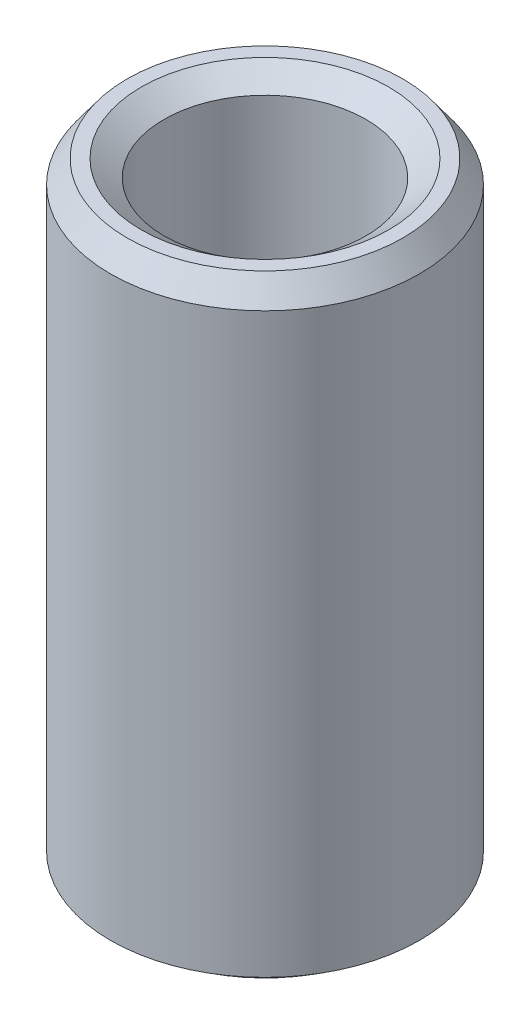
ISO-10303-21;
HEADER;
FILE_DESCRIPTION(('STEP AP214'),'2;1');
FILE_NAME('part.step','',(''),(''),'','','');
FILE_SCHEMA(('AUTOMOTIVE_DESIGN { 1 0 10303 214 1 1 1 1 }'));
ENDSEC;
DATA;
#1=APPLICATION_CONTEXT('core data for automotive mechanical design processes');
#2=APPLICATION_PROTOCOL_DEFINITION('international standard','automotive_design',2000,#1);
#3=PRODUCT_CONTEXT('',#1,'mechanical');
#4=PRODUCT('Part','Part','',(#3));
#5=PRODUCT_RELATED_PRODUCT_CATEGORY('part','',(#4));
#6=PRODUCT_DEFINITION_FORMATION('','',#4);
#7=PRODUCT_DEFINITION_CONTEXT('part definition',#1,'design');
#8=PRODUCT_DEFINITION('design','',#6,#7);
#9=PRODUCT_DEFINITION_SHAPE('','',#8);
#10=(LENGTH_UNIT() NAMED_UNIT(*) SI_UNIT(.MILLI.,.METRE.));
#11=(NAMED_UNIT(*) PLANE_ANGLE_UNIT() SI_UNIT($,.RADIAN.));
#12=(NAMED_UNIT(*) SI_UNIT($,.STERADIAN.) SOLID_ANGLE_UNIT());
#13=UNCERTAINTY_MEASURE_WITH_UNIT(LENGTH_MEASURE(1.E-05),#10,'distance_accuracy_value','');
#14=(GEOMETRIC_REPRESENTATION_CONTEXT(3) GLOBAL_UNCERTAINTY_ASSIGNED_CONTEXT((#13)) GLOBAL_UNIT_ASSIGNED_CONTEXT((#10,
#11,#12)) REPRESENTATION_CONTEXT('',''));
#15=CARTESIAN_POINT('',(0.,0.,0.));
#16=DIRECTION('',(0.,0.,1.));
#17=DIRECTION('',(1.,0.,0.));
#18=AXIS2_PLACEMENT_3D('',#15,#16,#17);
#19=CARTESIAN_POINT('',(0.,29.938073754065,0.));
#20=DIRECTION('',(0.,-1.,0.));
#21=DIRECTION('',(0.,0.,-1.));
#22=AXIS2_PLACEMENT_3D('',#19,#20,#21);
#23=CYLINDRICAL_SURFACE('',#22,7.5);
#24=CARTESIAN_POINT('',(0.,0.808139164973461,0.));
#25=DIRECTION('',(0.,1.,0.));
#26=DIRECTION('',(0.,0.,1.));
#27=AXIS2_PLACEMENT_3D('',#24,#25,#26);
#28=CIRCLE('',#27,7.5);
#29=CARTESIAN_POINT('',(0.,0.808139164973461,7.5));
#30=VERTEX_POINT('',#29);
#31=EDGE_CURVE('E10',#30,#30,#28,.T.);
#32=ORIENTED_EDGE('',*,*,#31,.T.);
#33=EDGE_LOOP('',(#32));
#34=FACE_BOUND('',#33,.T.);
#35=CARTESIAN_POINT('',(0.,28.8325355370839,0.));
#36=DIRECTION('',(0.,1.,0.));
#37=DIRECTION('',(0.,0.,1.));
#38=AXIS2_PLACEMENT_3D('',#35,#36,#37);
#39=CIRCLE('',#38,7.5);
#40=CARTESIAN_POINT('',(0.,28.8325355370839,7.5));
#41=VERTEX_POINT('',#40);
#42=EDGE_CURVE('E50',#41,#41,#39,.F.);
#43=ORIENTED_EDGE('',*,*,#42,.T.);
#44=EDGE_LOOP('',(#43));
#45=FACE_BOUND('',#44,.T.);
#46=ADVANCED_FACE('F39',(#34,#45),#23,.T.);
#47=CARTESIAN_POINT('',(0.,29.938073754065,0.));
#48=DIRECTION('',(0.,1.,0.));
#49=DIRECTION('',(0.,0.,1.));
#50=AXIS2_PLACEMENT_3D('',#47,#48,#49);
#51=PLANE('',#50);
#52=CARTESIAN_POINT('',(0.,29.938073754065,0.));
#53=DIRECTION('',(0.,1.,0.));
#54=DIRECTION('',(0.,0.,1.));
#55=AXIS2_PLACEMENT_3D('',#52,#53,#54);
#56=CIRCLE('',#55,6.00777478920314);
#57=CARTESIAN_POINT('',(0.,29.938073754065,6.00777478920314));
#58=VERTEX_POINT('',#57);
#59=EDGE_CURVE('E58',#58,#58,#56,.F.);
#60=ORIENTED_EDGE('',*,*,#59,.T.);
#61=EDGE_LOOP('',(#60));
#62=FACE_BOUND('',#61,.T.);
#63=CARTESIAN_POINT('',(0.,29.938073754065,0.));
#64=DIRECTION('',(0.,1.,0.));
#65=DIRECTION('',(0.,0.,1.));
#66=AXIS2_PLACEMENT_3D('',#63,#64,#65);
#67=CIRCLE('',#66,6.69186083502653);
#68=CARTESIAN_POINT('',(0.,29.938073754065,6.69186083502653));
#69=VERTEX_POINT('',#68);
#70=EDGE_CURVE('E61',#69,#69,#67,.T.);
#71=ORIENTED_EDGE('',*,*,#70,.T.);
#72=EDGE_LOOP('',(#71));
#73=FACE_BOUND('',#72,.T.);
#74=ADVANCED_FACE('F88',(#62,#73),#51,.T.);
#75=CARTESIAN_POINT('',(0.,0.,0.));
#76=DIRECTION('',(0.,1.,0.));
#77=DIRECTION('',(0.,0.,1.));
#78=AXIS2_PLACEMENT_3D('',#75,#76,#77);
#79=PLANE('',#78);
#80=CARTESIAN_POINT('',(0.,0.,0.));
#81=DIRECTION('',(0.,1.,0.));
#82=DIRECTION('',(0.,0.,1.));
#83=AXIS2_PLACEMENT_3D('',#80,#81,#82);
#84=CIRCLE('',#83,5.7103757371955);
#85=CARTESIAN_POINT('',(0.,0.,5.7103757371955));
#86=VERTEX_POINT('',#85);
#87=EDGE_CURVE('E51',#86,#86,#84,.T.);
#88=ORIENTED_EDGE('',*,*,#87,.T.);
#89=EDGE_LOOP('',(#88));
#90=FACE_BOUND('',#89,.T.);
#91=CARTESIAN_POINT('',(0.,0.,0.));
#92=DIRECTION('',(0.,1.,0.));
#93=DIRECTION('',(0.,0.,1.));
#94=AXIS2_PLACEMENT_3D('',#91,#92,#93);
#95=CIRCLE('',#94,6.39446178301889);
#96=CARTESIAN_POINT('',(0.,0.,6.39446178301889));
#97=VERTEX_POINT('',#96);
#98=EDGE_CURVE('E54',#97,#97,#95,.F.);
#99=ORIENTED_EDGE('',*,*,#98,.T.);
#100=EDGE_LOOP('',(#99));
#101=FACE_BOUND('',#100,.T.);
#102=ADVANCED_FACE('F83',(#90,#101),#79,.F.);
#103=CARTESIAN_POINT('',(0.,29.938073754065,0.));
#104=DIRECTION('',(0.,-1.,0.));
#105=DIRECTION('',(0.,0.,-1.));
#106=AXIS2_PLACEMENT_3D('',#103,#104,#105);
#107=CYLINDRICAL_SURFACE('',#106,4.90223657222204);
#108=CARTESIAN_POINT('',(0.,29.1299345890916,0.));
#109=DIRECTION('',(0.,1.,0.));
#110=DIRECTION('',(0.,0.,1.));
#111=AXIS2_PLACEMENT_3D('',#108,#109,#110);
#112=CIRCLE('',#111,4.90223657222204);
#113=CARTESIAN_POINT('',(0.,29.1299345890916,4.90223657222204));
#114=VERTEX_POINT('',#113);
#115=EDGE_CURVE('E67',#114,#114,#112,.T.);
#116=ORIENTED_EDGE('',*,*,#115,.T.);
#117=EDGE_LOOP('',(#116));
#118=FACE_BOUND('',#117,.T.);
#119=CARTESIAN_POINT('',(0.,1.10553821698111,0.));
#120=DIRECTION('',(0.,1.,0.));
#121=DIRECTION('',(0.,0.,1.));
#122=AXIS2_PLACEMENT_3D('',#119,#120,#121);
#123=CIRCLE('',#122,4.90223657222204);
#124=CARTESIAN_POINT('',(0.,1.10553821698111,4.90223657222204));
#125=VERTEX_POINT('',#124);
#126=EDGE_CURVE('E69',#125,#125,#123,.F.);
#127=ORIENTED_EDGE('',*,*,#126,.T.);
#128=EDGE_LOOP('',(#127));
#129=FACE_BOUND('',#128,.T.);
#130=ADVANCED_FACE('F71',(#118,#129),#107,.F.);
#131=CARTESIAN_POINT('',(0.,29.1299345890916,0.));
#132=DIRECTION('',(0.,1.,0.));
#133=DIRECTION('',(0.,0.,1.));
#134=AXIS2_PLACEMENT_3D('',#131,#132,#133);
#135=CONICAL_SURFACE('',#134,4.90223657222204,0.939571987757114);
#136=CARTESIAN_POINT('',(0.,29.938073754065,6.00777478920314));
#137=CARTESIAN_POINT('',(0.,29.9296556377632,5.99625876610959));
#138=CARTESIAN_POINT('',(0.,29.9212375214614,5.98474274301604));
#139=CARTESIAN_POINT('',(0.,29.9044012888578,5.96171069682893));
#140=CARTESIAN_POINT('',(0.,29.895983172556,5.95019467373538));
#141=CARTESIAN_POINT('',(0.,29.8791469399524,5.92716262754827));
#142=CARTESIAN_POINT('',(0.,29.8707288236506,5.91564660445472));
#143=CARTESIAN_POINT('',(0.,29.853892591047,5.89261455826761));
#144=CARTESIAN_POINT('',(0.,29.8454744747452,5.88109853517406));
#145=CARTESIAN_POINT('',(0.,29.8286382421415,5.85806648898695));
#146=CARTESIAN_POINT('',(0.,29.8202201258397,5.8465504658934));
#147=CARTESIAN_POINT('',(0.,29.8033838932361,5.82351841970629));
#148=CARTESIAN_POINT('',(0.,29.7949657769343,5.81200239661274));
#149=CARTESIAN_POINT('',(0.,29.7781295443307,5.78897035042563));
#150=CARTESIAN_POINT('',(0.,29.7697114280289,5.77745432733208));
#151=CARTESIAN_POINT('',(0.,29.7528751954253,5.75442228114497));
#152=CARTESIAN_POINT('',(0.,29.7444570791235,5.74290625805142));
#153=CARTESIAN_POINT('',(0.,29.7276208465199,5.71987421186431));
#154=CARTESIAN_POINT('',(0.,29.7192027302181,5.70835818877076));
#155=CARTESIAN_POINT('',(0.,29.7023664976144,5.68532614258365));
#156=CARTESIAN_POINT('',(0.,29.6939483813126,5.6738101194901));
#157=CARTESIAN_POINT('',(0.,29.677112148709,5.65077807330299));
#158=CARTESIAN_POINT('',(0.,29.6686940324072,5.63926205020944));
#159=CARTESIAN_POINT('',(0.,29.6518577998036,5.61623000402234));
#160=CARTESIAN_POINT('',(0.,29.6434396835018,5.60471398092878));
#161=CARTESIAN_POINT('',(0.,29.6266034508982,5.58168193474167));
#162=CARTESIAN_POINT('',(0.,29.6181853345964,5.57016591164812));
#163=CARTESIAN_POINT('',(0.,29.6013491019928,5.54713386546102));
#164=CARTESIAN_POINT('',(0.,29.5929309856909,5.53561784236746));
#165=CARTESIAN_POINT('',(0.,29.5760947530873,5.51258579618036));
#166=CARTESIAN_POINT('',(0.,29.5676766367855,5.5010697730868));
#167=CARTESIAN_POINT('',(0.,29.5508404041819,5.4780377268997));
#168=CARTESIAN_POINT('',(0.,29.5424222878801,5.46652170380614));
#169=CARTESIAN_POINT('',(0.,29.5255860552765,5.44348965761904));
#170=CARTESIAN_POINT('',(0.,29.5171679389747,5.43197363452548));
#171=CARTESIAN_POINT('',(0.,29.5003317063711,5.40894158833838));
#172=CARTESIAN_POINT('',(0.,29.4919135900693,5.39742556524483));
#173=CARTESIAN_POINT('',(0.,29.4750773574657,5.37439351905772));
#174=CARTESIAN_POINT('',(0.,29.4666592411638,5.36287749596416));
#175=CARTESIAN_POINT('',(0.,29.4498230085602,5.33984544977706));
#176=CARTESIAN_POINT('',(0.,29.4414048922584,5.32832942668351));
#177=CARTESIAN_POINT('',(0.,29.4245686596548,5.3052973804964));
#178=CARTESIAN_POINT('',(0.,29.416150543353,5.29378135740285));
#179=CARTESIAN_POINT('',(0.,29.3993143107494,5.27074931121574));
#180=CARTESIAN_POINT('',(0.,29.3908961944476,5.25923328812219));
#181=CARTESIAN_POINT('',(0.,29.374059961844,5.23620124193508));
#182=CARTESIAN_POINT('',(0.,29.3656418455422,5.22468521884153));
#183=CARTESIAN_POINT('',(0.,29.3488056129385,5.20165317265442));
#184=CARTESIAN_POINT('',(0.,29.3403874966367,5.19013714956087));
#185=CARTESIAN_POINT('',(0.,29.3235512640331,5.16710510337376));
#186=CARTESIAN_POINT('',(0.,29.3151331477313,5.15558908028021));
#187=CARTESIAN_POINT('',(0.,29.2982969151277,5.1325570340931));
#188=CARTESIAN_POINT('',(0.,29.2898787988259,5.12104101099955));
#189=CARTESIAN_POINT('',(0.,29.2730425662223,5.09800896481244));
#190=CARTESIAN_POINT('',(0.,29.2646244499205,5.08649294171889));
#191=CARTESIAN_POINT('',(0.,29.2477882173169,5.06346089553178));
#192=CARTESIAN_POINT('',(0.,29.2393701010151,5.05194487243823));
#193=CARTESIAN_POINT('',(0.,29.2225338684114,5.02891282625112));
#194=CARTESIAN_POINT('',(0.,29.2141157521096,5.01739680315757));
#195=CARTESIAN_POINT('',(0.,29.197279519506,4.99436475697046));
#196=CARTESIAN_POINT('',(0.,29.1888614032042,4.98284873387691));
#197=CARTESIAN_POINT('',(0.,29.1720251706006,4.9598166876898));
#198=CARTESIAN_POINT('',(0.,29.1636070542988,4.94830066459625));
#199=CARTESIAN_POINT('',(0.,29.1467708216952,4.92526861840915));
#200=CARTESIAN_POINT('',(0.,29.1383527053934,4.91375259531559));
#201=CARTESIAN_POINT('',(0.,29.1299345890916,4.90223657222204));
#202=B_SPLINE_CURVE_WITH_KNOTS('',3,(#136,#137,#138,#139,#140,#141,#142,#143,#144,#145,#146,
#147,#148,#149,#150,#151,#152,#153,#154,#155,#156,#157,#158,#159,#160,#161,#162,#163,#164,#165,
#166,#167,#168,#169,#170,#171,#172,#173,#174,#175,#176,#177,#178,#179,#180,#181,#182,#183,#184,
#185,#186,#187,#188,#189,#190,#191,#192,#193,#194,#195,#196,#197,#198,#199,#200,#201),
.UNSPECIFIED.,.F.,.F.,(4,2,2,2,2,2,2,2,2,2,2,2,2,2,2,2,2,2,2,2,2,2,2,2,2,2,2,2,2,2,2,2,4),(0.,
0.0427942896851644,0.0855885793703315,0.128382869055498,0.171177158740665,0.213971448425832,
0.256765738110999,0.299560027796165,0.342354317481332,0.385148607166499,0.427942896851666,
0.470737186536832,0.513531476221997,0.556325765907164,0.599120055592331,0.641914345277497,
0.684708634962665,0.727502924647831,0.770297214332998,0.813091504018165,0.855885793703332,
0.898680083388498,0.941474373073663,0.98426866275883,1.027062952444,1.06985724212916,
1.11265153181433,1.1554458214995,1.19824011118466,1.24103440086983,1.283828690555,
1.32662298024016,1.36941726992533),.UNSPECIFIED.);
#203=EDGE_CURVE('BSEAM77',#58,#114,#202,.T.);
#204=ORIENTED_EDGE('',*,*,#59,.F.);
#205=ORIENTED_EDGE('',*,*,#115,.F.);
#206=ORIENTED_EDGE('',*,*,#203,.T.);
#207=ORIENTED_EDGE('',*,*,#203,.F.);
#208=EDGE_LOOP('',(#204,#206,#205,#207));
#209=FACE_BOUND('',#208,.T.);
#210=ADVANCED_FACE('F77',(#209),#135,.F.);
#211=CARTESIAN_POINT('',(0.,0.,0.));
#212=DIRECTION('',(0.,-1.,0.));
#213=DIRECTION('',(0.,0.,-1.));
#214=AXIS2_PLACEMENT_3D('',#211,#212,#213);
#215=CONICAL_SURFACE('',#214,5.7103757371955,0.631224339037782);
#216=ORIENTED_EDGE('',*,*,#126,.F.);
#217=EDGE_LOOP('',(#216));
#218=FACE_BOUND('',#217,.T.);
#219=ORIENTED_EDGE('',*,*,#87,.F.);
#220=EDGE_LOOP('',(#219));
#221=FACE_BOUND('',#220,.T.);
#222=ADVANCED_FACE('F73',(#218,#221),#215,.F.);
#223=CARTESIAN_POINT('',(0.,0.808139164973461,0.));
#224=DIRECTION('',(0.,1.,0.));
#225=DIRECTION('',(0.,0.,1.));
#226=AXIS2_PLACEMENT_3D('',#223,#224,#225);
#227=CONICAL_SURFACE('',#226,7.5,0.939571987757114);
#228=ORIENTED_EDGE('',*,*,#98,.F.);
#229=EDGE_LOOP('',(#228));
#230=FACE_BOUND('',#229,.T.);
#231=ORIENTED_EDGE('',*,*,#31,.F.);
#232=EDGE_LOOP('',(#231));
#233=FACE_BOUND('',#232,.T.);
#234=ADVANCED_FACE('F76',(#230,#233),#227,.T.);
#235=CARTESIAN_POINT('',(0.,29.938073754065,0.));
#236=DIRECTION('',(0.,-1.,0.));
#237=DIRECTION('',(0.,0.,-1.));
#238=AXIS2_PLACEMENT_3D('',#235,#236,#237);
#239=CONICAL_SURFACE('',#238,6.69186083502653,0.631224339037785);
#240=ORIENTED_EDGE('',*,*,#42,.F.);
#241=EDGE_LOOP('',(#240));
#242=FACE_BOUND('',#241,.T.);
#243=ORIENTED_EDGE('',*,*,#70,.F.);
#244=EDGE_LOOP('',(#243));
#245=FACE_BOUND('',#244,.T.);
#246=ADVANCED_FACE('F45',(#242,#245),#239,.T.);
#247=CLOSED_SHELL('',(#46,#74,#102,#130,#210,#222,#234,#246));
#248=MANIFOLD_SOLID_BREP('B2',#247);
#249=ADVANCED_BREP_SHAPE_REPRESENTATION('',(#18,#248),#14);
#250=SHAPE_DEFINITION_REPRESENTATION(#9,#249);
ENDSEC;
END-ISO-10303-21;
